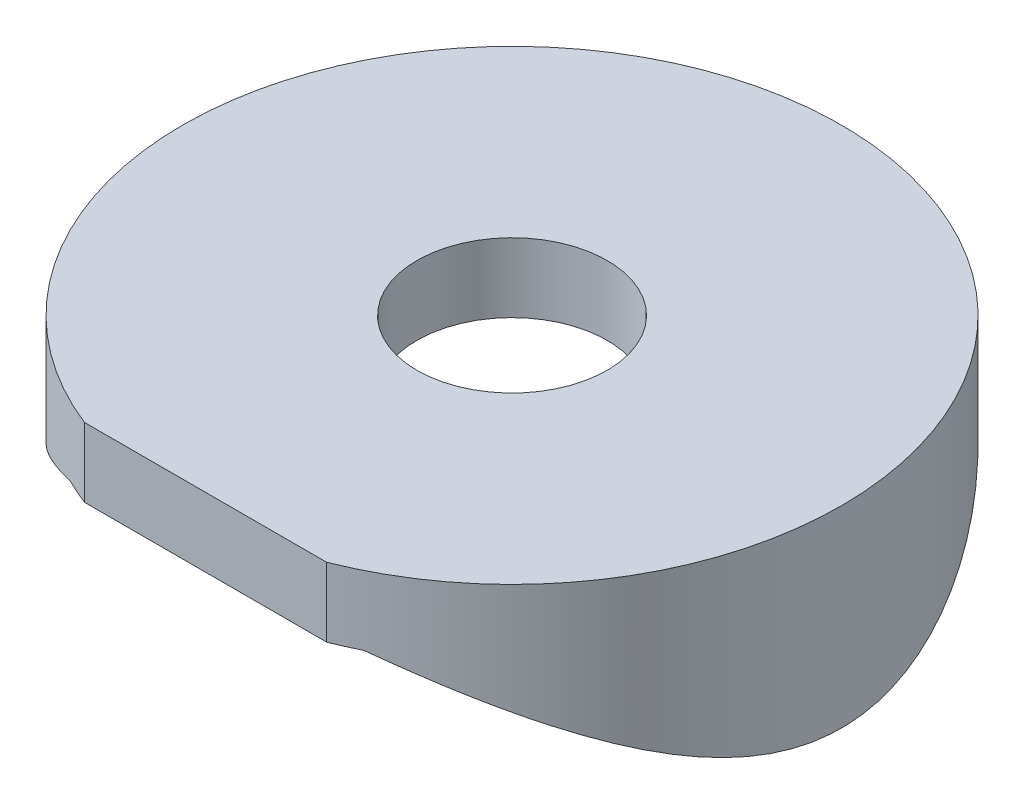
ISO-10303-21;
HEADER;
FILE_DESCRIPTION(('STEP AP214'),'2;1');
FILE_NAME('part.step','',(''),(''),'','','');
FILE_SCHEMA(('AUTOMOTIVE_DESIGN { 1 0 10303 214 1 1 1 1 }'));
ENDSEC;
DATA;
#1=APPLICATION_CONTEXT('core data for automotive mechanical design processes');
#2=APPLICATION_PROTOCOL_DEFINITION('international standard','automotive_design',2000,#1);
#3=PRODUCT_CONTEXT('',#1,'mechanical');
#4=PRODUCT('Part','Part','',(#3));
#5=PRODUCT_RELATED_PRODUCT_CATEGORY('part','',(#4));
#6=PRODUCT_DEFINITION_FORMATION('','',#4);
#7=PRODUCT_DEFINITION_CONTEXT('part definition',#1,'design');
#8=PRODUCT_DEFINITION('design','',#6,#7);
#9=PRODUCT_DEFINITION_SHAPE('','',#8);
#10=(LENGTH_UNIT() NAMED_UNIT(*) SI_UNIT(.MILLI.,.METRE.));
#11=(NAMED_UNIT(*) PLANE_ANGLE_UNIT() SI_UNIT($,.RADIAN.));
#12=(NAMED_UNIT(*) SI_UNIT($,.STERADIAN.) SOLID_ANGLE_UNIT());
#13=UNCERTAINTY_MEASURE_WITH_UNIT(LENGTH_MEASURE(1.E-05),#10,'distance_accuracy_value','');
#14=(GEOMETRIC_REPRESENTATION_CONTEXT(3) GLOBAL_UNCERTAINTY_ASSIGNED_CONTEXT((#13)) GLOBAL_UNIT_ASSIGNED_CONTEXT((#10,
#11,#12)) REPRESENTATION_CONTEXT('',''));
#15=CARTESIAN_POINT('',(0.,0.,0.));
#16=DIRECTION('',(0.,0.,1.));
#17=DIRECTION('',(1.,0.,0.));
#18=AXIS2_PLACEMENT_3D('',#15,#16,#17);
#19=CARTESIAN_POINT('',(0.,2.,0.));
#20=DIRECTION('',(0.,-1.,0.));
#21=DIRECTION('',(0.,0.,-1.));
#22=AXIS2_PLACEMENT_3D('',#19,#20,#21);
#23=CYLINDRICAL_SURFACE('',#22,9.525);
#24=CARTESIAN_POINT('',(0.,0.,0.));
#25=DIRECTION('',(0.,1.,0.));
#26=DIRECTION('',(0.,0.,1.));
#27=AXIS2_PLACEMENT_3D('',#24,#25,#26);
#28=CIRCLE('',#27,9.525);
#29=CARTESIAN_POINT('',(-4.24371299689314,0.,8.52739848957467));
#30=VERTEX_POINT('',#29);
#31=CARTESIAN_POINT('',(-3.5,0.,8.85864690570744));
#32=VERTEX_POINT('',#31);
#33=EDGE_CURVE('E92',#30,#32,#28,.T.);
#34=ORIENTED_EDGE('',*,*,#33,.T.);
#35=DIRECTION('',(0.,1.,0.));
#36=VECTOR('',#35,1.);
#37=CARTESIAN_POINT('',(-3.5,-4.28727802090018,8.85864690570744));
#38=LINE('',#37,#36);
#39=CARTESIAN_POINT('',(-3.5,2.,8.85864690570744));
#40=VERTEX_POINT('',#39);
#41=EDGE_CURVE('E52',#32,#40,#38,.T.);
#42=ORIENTED_EDGE('',*,*,#41,.T.);
#43=CARTESIAN_POINT('',(0.,2.,0.));
#44=DIRECTION('',(0.,1.,0.));
#45=DIRECTION('',(0.,0.,1.));
#46=AXIS2_PLACEMENT_3D('',#43,#44,#45);
#47=CIRCLE('',#46,9.525);
#48=CARTESIAN_POINT('',(3.5,2.,8.85864690570744));
#49=VERTEX_POINT('',#48);
#50=EDGE_CURVE('E45',#49,#40,#47,.T.);
#51=ORIENTED_EDGE('',*,*,#50,.F.);
#52=DIRECTION('',(0.,1.,0.));
#53=VECTOR('',#52,1.);
#54=CARTESIAN_POINT('',(3.5,-4.28727802090018,8.85864690570744));
#55=LINE('',#54,#53);
#56=CARTESIAN_POINT('',(3.5,0.,8.85864690570744));
#57=VERTEX_POINT('',#56);
#58=EDGE_CURVE('E75',#57,#49,#55,.T.);
#59=ORIENTED_EDGE('',*,*,#58,.F.);
#60=CARTESIAN_POINT('',(4.24371299689325,0.,8.52739848957461));
#61=VERTEX_POINT('',#60);
#62=EDGE_CURVE('E93',#57,#61,#28,.T.);
#63=ORIENTED_EDGE('',*,*,#62,.T.);
#64=CARTESIAN_POINT('',(0.,0.730000000000008,9.525));
#65=CARTESIAN_POINT('',(-0.232598410215062,0.729997784880346,9.52499770537466));
#66=CARTESIAN_POINT('',(-0.465255043659899,0.723594419233629,9.51646441280711));
#67=CARTESIAN_POINT('',(-0.928731542203984,0.698124794080122,9.48246454253932));
#68=CARTESIAN_POINT('',(-1.15955022456092,0.679050957536793,9.45698783253794));
#69=CARTESIAN_POINT('',(-1.61788138907552,0.628639507931946,9.38945410865233));
#70=CARTESIAN_POINT('',(-1.84538601285295,0.597276517669206,9.34736278411965));
#71=CARTESIAN_POINT('',(-2.29495024679384,0.52300312285786,9.24726320460812));
#72=CARTESIAN_POINT('',(-2.51700921204194,0.480091357754493,9.18925307422776));
#73=CARTESIAN_POINT('',(-2.95287619196027,0.383947739118806,9.05856475718707));
#74=CARTESIAN_POINT('',(-3.16672702846888,0.330781918858265,8.98598030840226));
#75=CARTESIAN_POINT('',(-3.58650782411301,0.2150061841728,8.82683302993598));
#76=CARTESIAN_POINT('',(-3.79243753837846,0.152395978082289,8.74026976854897));
#77=CARTESIAN_POINT('',(-4.19537242080673,0.0189061870722155,8.55416263232319));
#78=CARTESIAN_POINT('',(-4.39238304196275,-0.0519682477914907,8.45462683713033));
#79=CARTESIAN_POINT('',(-4.77703365278765,-0.200866504160065,8.24340590594804));
#80=CARTESIAN_POINT('',(-4.96467037099412,-0.278892795079052,8.1317165710379));
#81=CARTESIAN_POINT('',(-5.3469201514456,-0.448364136377898,7.88621098652338));
#82=CARTESIAN_POINT('',(-5.54057769573136,-0.540382977432084,7.75130388739916));
#83=CARTESIAN_POINT('',(-5.91568315667958,-0.729943727963059,7.4689650749191));
#84=CARTESIAN_POINT('',(-6.09712948399906,-0.827486353353695,7.3215317368469));
#85=CARTESIAN_POINT('',(-6.44778420780654,-1.02665526281829,7.01470349485184));
#86=CARTESIAN_POINT('',(-6.61697329945017,-1.12828761270504,6.85529049449163));
#87=CARTESIAN_POINT('',(-6.94253873877991,-1.3338253104432,6.52537216795236));
#88=CARTESIAN_POINT('',(-7.09891856083469,-1.43773003218695,6.35486987227902));
#89=CARTESIAN_POINT('',(-7.42924361456874,-1.66735037142117,5.96735473556684));
#90=CARTESIAN_POINT('',(-7.60028683022929,-1.79320133941891,5.74793814872372));
#91=CARTESIAN_POINT('',(-7.92317135813283,-2.04251439337706,5.29401574987367));
#92=CARTESIAN_POINT('',(-8.07500688015765,-2.16597574952667,5.05950541980315));
#93=CARTESIAN_POINT('',(-8.35856892368081,-2.40658801411154,4.57585064363559));
#94=CARTESIAN_POINT('',(-8.49031554436688,-2.52374515301034,4.32672117448652));
#95=CARTESIAN_POINT('',(-8.73266391872264,-2.7473240142314,3.81400842014086));
#96=CARTESIAN_POINT('',(-8.84327771034297,-2.85375183190743,3.55043347434462));
#97=CARTESIAN_POINT('',(-9.07289082290386,-3.08144818265368,2.92423440345876));
#98=CARTESIAN_POINT('',(-9.18375570494739,-3.19700125153533,2.55634618964748));
#99=CARTESIAN_POINT('',(-9.31693272394686,-3.33929966216403,1.98949342967779));
#100=CARTESIAN_POINT('',(-9.35579238340935,-3.38154546689201,1.79815152694902));
#101=CARTESIAN_POINT('',(-9.42190755651645,-3.45412803377018,1.41128534343643));
#102=CARTESIAN_POINT('',(-9.44916905017662,-3.48447093242942,1.21576327269906));
#103=CARTESIAN_POINT('',(-9.49175093120859,-3.53212661475591,0.819931641751597));
#104=CARTESIAN_POINT('',(-9.50695584288417,-3.54931333820688,0.619594283090086));
#105=CARTESIAN_POINT('',(-9.52463756517345,-3.5693177399549,0.217634688605466));
#106=CARTESIAN_POINT('',(-9.52711472502685,-3.57213581251663,0.0160124881894216));
#107=CARTESIAN_POINT('',(-9.51927797472328,-3.56325395323358,-0.386721449637988));
#108=CARTESIAN_POINT('',(-9.50895987824804,-3.55154926987107,-0.587832998399292));
#109=CARTESIAN_POINT('',(-9.47577623694839,-3.51421609025589,-0.987696955891022));
#110=CARTESIAN_POINT('',(-9.45291056428638,-3.48858745214278,-1.18644934056466));
#111=CARTESIAN_POINT('',(-9.39823752221162,-3.42806853081765,-1.55894115012889));
#112=CARTESIAN_POINT('',(-9.36765398506627,-3.39446829558903,-1.73307473249719));
#113=CARTESIAN_POINT('',(-9.29733840597253,-3.31828412819697,-2.07751040116684));
#114=CARTESIAN_POINT('',(-9.25760310066884,-3.27569699192173,-2.2478110968948));
#115=CARTESIAN_POINT('',(-9.12533489778873,-3.13627797804692,-2.75221284355744));
#116=CARTESIAN_POINT('',(-9.01974467653151,-3.02779425061329,-3.07978065823463));
#117=CARTESIAN_POINT('',(-8.8000444037426,-2.81203662394534,-3.65531877609699));
#118=CARTESIAN_POINT('',(-8.69120308451011,-2.70831623343432,-3.90673413640179));
#119=CARTESIAN_POINT('',(-8.45417087520837,-2.49145559832314,-4.39619617446638));
#120=CARTESIAN_POINT('',(-8.32597006166463,-2.3783105361493,-4.63423590966027));
#121=CARTESIAN_POINT('',(-8.05095146916488,-2.14632334929958,-5.0971022094459));
#122=CARTESIAN_POINT('',(-7.9040955958821,-2.02746988572317,-5.32190031914974));
#123=CARTESIAN_POINT('',(-7.59262434428233,-1.78762834789266,-5.75754782161201));
#124=CARTESIAN_POINT('',(-7.42801175042008,-1.66664061079853,-5.96839939300437));
#125=CARTESIAN_POINT('',(-7.07704198259703,-1.42237752070336,-6.38093102271132));
#126=CARTESIAN_POINT('',(-6.89024071851348,-1.2991215398823,-6.58224508359024));
#127=CARTESIAN_POINT('',(-6.49870467149545,-1.05625102883639,-6.9690884796366));
#128=CARTESIAN_POINT('',(-6.29396807655043,-0.936636868194333,-7.15461621616678));
#129=CARTESIAN_POINT('',(-5.86731757455831,-0.70396557351388,-7.50845411534218));
#130=CARTESIAN_POINT('',(-5.64543332737852,-0.590897684078483,-7.67679288800723));
#131=CARTESIAN_POINT('',(-5.18476666294529,-0.373750997855305,-7.9951332282049));
#132=CARTESIAN_POINT('',(-4.94598858661175,-0.269669907035173,-8.14513947950929));
#133=CARTESIAN_POINT('',(-4.50194089789183,-0.0928099687980695,-8.39699949041203));
#134=CARTESIAN_POINT('',(-4.29955325234083,-0.0179393548401607,-8.50247725126351));
#135=CARTESIAN_POINT('',(-3.88524637203775,0.123085541101078,-8.69960271359745));
#136=CARTESIAN_POINT('',(-3.67332910865343,0.189241614813856,-8.79125325855205));
#137=CARTESIAN_POINT('',(-3.2409450414914,0.311560601891129,-8.95967102699971));
#138=CARTESIAN_POINT('',(-3.02048147562512,0.367727255708785,-9.03644382230828));
#139=CARTESIAN_POINT('',(-2.57214112621953,0.468926522258746,-9.174132017935));
#140=CARTESIAN_POINT('',(-2.34426424751586,0.513958991998155,-9.23504721459943));
#141=CARTESIAN_POINT('',(-1.88117485070086,0.592111886323232,-9.34042495997333));
#142=CARTESIAN_POINT('',(-1.64592540434317,0.625156151742246,-9.38478236939886));
#143=CARTESIAN_POINT('',(-1.17129174786374,0.678125875707877,-9.45575338512122));
#144=CARTESIAN_POINT('',(-0.931907527675333,0.698051302310307,-9.48236694821203));
#145=CARTESIAN_POINT('',(-0.451142731263297,0.724266652092926,-9.51736126051501));
#146=CARTESIAN_POINT('',(-0.209762847738749,0.730561122326416,-9.52574808985633));
#147=CARTESIAN_POINT('',(0.27289015225441,0.729360431594552,-9.52414731524006));
#148=CARTESIAN_POINT('',(0.514163275637536,0.721866357233833,-9.51416115916342));
#149=CARTESIAN_POINT('',(0.970221530746234,0.694734031928875,-9.4779342008517));
#150=CARTESIAN_POINT('',(1.18522594140875,0.676395578391791,-9.45343269028808));
#151=CARTESIAN_POINT('',(1.61193413451316,0.629116805193818,-9.39009127710347));
#152=CARTESIAN_POINT('',(1.82363781836563,0.600176169486339,-9.35125094704804));
#153=CARTESIAN_POINT('',(2.24240408735165,0.532264940815693,-9.25976200838159));
#154=CARTESIAN_POINT('',(2.44946630582467,0.493293558470771,-9.20711231301963));
#155=CARTESIAN_POINT('',(2.85778253113195,0.406052443060447,-9.088668888766));
#156=CARTESIAN_POINT('',(3.05903624715196,0.357782245356706,-9.02287450306122));
#157=CARTESIAN_POINT('',(3.46170832674589,0.250943607556622,-8.87635576566656));
#158=CARTESIAN_POINT('',(3.66288564173447,0.19207372313834,-8.79518925912205));
#159=CARTESIAN_POINT('',(4.05718446784902,0.0662840214620441,-8.62040770245547));
#160=CARTESIAN_POINT('',(4.25030324917307,-0.000638494259444614,-8.52678847827211));
#161=CARTESIAN_POINT('',(4.81639459025745,-0.211839638853181,-8.22859279471437));
#162=CARTESIAN_POINT('',(5.17640496546013,-0.366634718629805,-8.00656644809868));
#163=CARTESIAN_POINT('',(5.91519395517861,-0.722972838905428,-7.48161937195305));
#164=CARTESIAN_POINT('',(6.28706649712474,-0.928005706952503,-7.17138137065575));
#165=CARTESIAN_POINT('',(6.80424268286757,-1.24463586244904,-6.66976691949619));
#166=CARTESIAN_POINT('',(6.97007726754383,-1.35185774012789,-6.49623611830711));
#167=CARTESIAN_POINT('',(7.28787473274478,-1.56741903764504,-6.13757980438894));
#168=CARTESIAN_POINT('',(7.4398409596681,-1.67575818083018,-5.9524571070298));
#169=CARTESIAN_POINT('',(7.75723803942549,-1.91209280572885,-5.53463917269903));
#170=CARTESIAN_POINT('',(7.91972498268418,-2.03990407034961,-5.29959643233718));
#171=CARTESIAN_POINT('',(8.22407002224665,-2.29045842955248,-4.81377999942571));
#172=CARTESIAN_POINT('',(8.36592053924664,-2.41319965022731,-4.56300057529893));
#173=CARTESIAN_POINT('',(8.62755269861824,-2.6487213290124,-4.04655038326069));
#174=CARTESIAN_POINT('',(8.74738621632674,-2.76152486637515,-3.78091659375439));
#175=CARTESIAN_POINT('',(8.96374931342852,-2.97200160800696,-3.23465027320813));
#176=CARTESIAN_POINT('',(9.06029821303677,-3.0696873318697,-2.95403041454931));
#177=CARTESIAN_POINT('',(9.19538088925355,-3.20983797334353,-2.49080457004184));
#178=CARTESIAN_POINT('',(9.24187536139896,-3.25900515081518,-2.31251593858914));
#179=CARTESIAN_POINT('',(9.32482041082044,-3.34785294965306,-1.95132131428183));
#180=CARTESIAN_POINT('',(9.36127451051946,-3.38753689733377,-1.76841696538631));
#181=CARTESIAN_POINT('',(9.42353799998037,-3.45594828483805,-1.39912452394422));
#182=CARTESIAN_POINT('',(9.44936706451035,-3.48469596824904,-1.21274354461994));
#183=CARTESIAN_POINT('',(9.49000430527952,-3.5301685187507,-0.837308190666257));
#184=CARTESIAN_POINT('',(9.50481245367254,-3.54689335546365,-0.648253809283296));
#185=CARTESIAN_POINT('',(9.52314437277054,-3.56762421254677,-0.26791206996816));
#186=CARTESIAN_POINT('',(9.52660955944233,-3.5715642009321,-0.0766182244930239));
#187=CARTESIAN_POINT('',(9.522013669086,-3.56635398935977,0.305644636727682));
#188=CARTESIAN_POINT('',(9.51395283428797,-3.55720406449882,0.496613659215265));
#189=CARTESIAN_POINT('',(9.48646814919033,-3.52622444426626,0.876886431391754));
#190=CARTESIAN_POINT('',(9.46703227819562,-3.50438133540583,1.06618820406326));
#191=CARTESIAN_POINT('',(9.4171788310777,-3.44896005188882,1.44161378002301));
#192=CARTESIAN_POINT('',(9.38675856553493,-3.41537900337912,1.62773679332552));
#193=CARTESIAN_POINT('',(9.30767924601065,-3.32932726010564,2.03589019382673));
#194=CARTESIAN_POINT('',(9.25648934050815,-3.27433411131779,2.25689863354629));
#195=CARTESIAN_POINT('',(9.13962283852913,-3.15158422019759,2.69138962783801));
#196=CARTESIAN_POINT('',(9.0739426039947,-3.08382427315555,2.90487027678351));
#197=CARTESIAN_POINT('',(8.92891861580555,-2.93811255284954,3.32405323602266));
#198=CARTESIAN_POINT('',(8.84954684631997,-2.8601399626515,3.52973852149874));
#199=CARTESIAN_POINT('',(8.67804737841284,-2.69662200106418,3.93256277868965));
#200=CARTESIAN_POINT('',(8.58591891895747,-2.61107617798372,4.1297012395992));
#201=CARTESIAN_POINT('',(8.35544253943861,-2.40401039218452,4.58226872121156));
#202=CARTESIAN_POINT('',(8.21214891636628,-2.28030703718295,4.83419018387519));
#203=CARTESIAN_POINT('',(7.90459935313562,-2.02782027405293,5.32223267247765));
#204=CARTESIAN_POINT('',(7.74033688147033,-1.89903529174028,5.55834874017188));
#205=CARTESIAN_POINT('',(7.39140210770499,-1.6402177808203,6.01459276960201));
#206=CARTESIAN_POINT('',(7.20671452161751,-1.51018438538748,6.23470855150504));
#207=CARTESIAN_POINT('',(6.81750117884972,-1.2524367874192,6.65807524373903));
#208=CARTESIAN_POINT('',(6.61297783315312,-1.12472230526073,6.86132819814344));
#209=CARTESIAN_POINT('',(6.1826577465037,-0.87372545971166,7.25158134676273));
#210=CARTESIAN_POINT('',(5.95669661996761,-0.750489381997961,7.43843054367878));
#211=CARTESIAN_POINT('',(5.4854650865437,-0.512717734465105,7.79244058955538));
#212=CARTESIAN_POINT('',(5.24019216196744,-0.398183302921064,7.95959886428652));
#213=CARTESIAN_POINT('',(4.73172065539361,-0.181145579604288,8.27195851989296));
#214=CARTESIAN_POINT('',(4.46855745724529,-0.0786195719222192,8.41720151229645));
#215=CARTESIAN_POINT('',(3.92535711682987,0.111566788185704,8.68381302574894));
#216=CARTESIAN_POINT('',(3.64532878107418,0.199234809375021,8.80519386815417));
#217=CARTESIAN_POINT('',(3.15483755647595,0.33371588112683,8.98998255594973));
#218=CARTESIAN_POINT('',(2.94803837890464,0.384972532159451,9.05995519747715));
#219=CARTESIAN_POINT('',(2.52811536027709,0.477683378935717,9.18598243919434));
#220=CARTESIAN_POINT('',(2.31499306895248,0.519139954603647,9.24204041869143));
#221=CARTESIAN_POINT('',(1.8841572616285,0.591351791336954,9.3393921612898));
#222=CARTESIAN_POINT('',(1.66645561414227,0.622131787630007,9.38072005688152));
#223=CARTESIAN_POINT('',(1.2275063095186,0.672467167534588,9.44818018779917));
#224=CARTESIAN_POINT('',(1.00626052537573,0.692028291173255,9.47432019395067));
#225=CARTESIAN_POINT('',(0.653841602201369,0.713829749081087,9.50343133828639));
#226=CARTESIAN_POINT('',(0.523297100981911,0.719888168498215,9.51151406370336));
#227=CARTESIAN_POINT('',(0.261841253101264,0.727974241837611,9.52229947341923));
#228=CARTESIAN_POINT('',(0.130929850781394,0.730001246892825,9.52500129164664));
#229=CARTESIAN_POINT('',(0.,0.730000000000008,9.525));
#230=B_SPLINE_CURVE_WITH_KNOTS('',3,(#64,#65,#66,#67,#68,#69,#70,#71,#72,#73,#74,#75,#76,#77,
#78,#79,#80,#81,#82,#83,#84,#85,#86,#87,#88,#89,#90,#91,#92,#93,#94,#95,#96,#97,#98,#99,#100,
#101,#102,#103,#104,#105,#106,#107,#108,#109,#110,#111,#112,#113,#114,#115,#116,#117,#118,#119,
#120,#121,#122,#123,#124,#125,#126,#127,#128,#129,#130,#131,#132,#133,#134,#135,#136,#137,#138,
#139,#140,#141,#142,#143,#144,#145,#146,#147,#148,#149,#150,#151,#152,#153,#154,#155,#156,#157,
#158,#159,#160,#161,#162,#163,#164,#165,#166,#167,#168,#169,#170,#171,#172,#173,#174,#175,#176,
#177,#178,#179,#180,#181,#182,#183,#184,#185,#186,#187,#188,#189,#190,#191,#192,#193,#194,#195,
#196,#197,#198,#199,#200,#201,#202,#203,#204,#205,#206,#207,#208,#209,#210,#211,#212,#213,#214,
#215,#216,#217,#218,#219,#220,#221,#222,#223,#224,#225,#226,#227,#228,#229),.UNSPECIFIED.,.T.,
.F.,(4,2,2,2,2,2,2,2,2,2,2,2,2,2,2,2,2,2,2,2,2,2,2,2,2,2,2,2,2,2,2,2,2,2,2,2,2,2,2,2,2,2,2,2,2,
2,2,2,2,2,2,2,2,2,2,2,2,2,2,2,2,2,2,2,2,2,2,2,2,2,2,2,2,2,2,2,2,2,2,2,2,2,4),(0.,
0.697653939203348,1.39572545671891,2.09524615954066,2.79484930861046,3.49008918717023,
4.18535054082455,4.88018091793173,5.57525211844908,6.33450107360671,7.09384865796304,
7.85436730572987,8.61467898363796,9.52972294108569,10.4450420873266,11.3594393503664,
12.2733141795704,13.4720636536311,14.0707617501802,14.6691507827158,15.2732040896344,
15.8772408217077,16.4814752330797,17.0857158006462,17.625072098054,18.1646210187582,
19.2438192310668,20.121586664938,20.9998055701551,21.8798475618315,22.759751753028,
23.6618728890973,24.5640852720137,25.464770620735,26.3652253703431,27.0851175984788,
27.804861583331,28.5243354961711,29.2438186485131,29.9677956754763,30.6917744653067,
31.4155117110018,32.1391919251112,32.7899506227011,33.4407287207127,34.0915580481619,
34.7424199043493,35.4160747981347,36.089956067903,37.4367284882632,39.0084124228297,
39.7965847597036,40.5845664069831,41.5225526124656,42.4608824545274,43.3969722767133,
44.3322826932026,44.9039045531831,45.475325617213,46.0456837443115,46.6160433125094,
47.1893440594319,47.7626327580819,48.3365283825988,48.9105646151239,49.6097971207487,
50.3092053814685,51.0100621369594,51.7109607219282,52.6550455615981,53.5994251915141,
54.5445163385171,55.4894927558339,56.4424133450236,57.3954583732926,58.3466704026116,
59.29738997064,59.9694860146033,60.64141867363,61.3117840524026,61.9818061385663,
62.3744529653761,62.7671629846428),.UNSPECIFIED.);
#231=CARTESIAN_POINT('',(4.24371299689325,0.,-8.52739848957461));
#232=VERTEX_POINT('',#231);
#233=EDGE_CURVE('E118',#232,#61,#230,.T.);
#234=ORIENTED_EDGE('',*,*,#233,.F.);
#235=CARTESIAN_POINT('',(-4.24371299689314,0.,-8.52739848957466));
#236=VERTEX_POINT('',#235);
#237=EDGE_CURVE('E89',#232,#236,#28,.T.);
#238=ORIENTED_EDGE('',*,*,#237,.T.);
#239=EDGE_CURVE('E58',#30,#236,#230,.T.);
#240=ORIENTED_EDGE('',*,*,#239,.F.);
#241=EDGE_LOOP('',(#34,#42,#51,#59,#63,#234,#238,#240));
#242=FACE_BOUND('',#241,.T.);
#243=ADVANCED_FACE('F38',(#242),#23,.T.);
#244=CARTESIAN_POINT('',(0.,2.,0.));
#245=DIRECTION('',(0.,1.,0.));
#246=DIRECTION('',(0.,0.,1.));
#247=AXIS2_PLACEMENT_3D('',#244,#245,#246);
#248=PLANE('',#247);
#249=DIRECTION('',(-1.,0.,0.));
#250=VECTOR('',#249,1.);
#251=CARTESIAN_POINT('',(-3.5,2.,8.85864690570744));
#252=LINE('',#251,#250);
#253=EDGE_CURVE('E78',#49,#40,#252,.T.);
#254=ORIENTED_EDGE('',*,*,#253,.F.);
#255=ORIENTED_EDGE('',*,*,#50,.T.);
#256=EDGE_LOOP('',(#254,#255));
#257=FACE_BOUND('',#256,.T.);
#258=CARTESIAN_POINT('',(0.,2.,0.));
#259=DIRECTION('',(0.,1.,0.));
#260=DIRECTION('',(0.,0.,1.));
#261=AXIS2_PLACEMENT_3D('',#258,#259,#260);
#262=CIRCLE('',#261,2.74999999999999);
#263=CARTESIAN_POINT('',(0.,2.,2.74999999999999));
#264=VERTEX_POINT('',#263);
#265=EDGE_CURVE('E101',#264,#264,#262,.T.);
#266=ORIENTED_EDGE('',*,*,#265,.F.);
#267=EDGE_LOOP('',(#266));
#268=FACE_BOUND('',#267,.T.);
#269=ADVANCED_FACE('F85',(#257,#268),#248,.T.);
#270=CARTESIAN_POINT('',(0.,0.,0.));
#271=DIRECTION('',(0.,1.,0.));
#272=DIRECTION('',(0.,0.,1.));
#273=AXIS2_PLACEMENT_3D('',#270,#271,#272);
#274=PLANE('',#273);
#275=CARTESIAN_POINT('',(0.,0.,0.));
#276=DIRECTION('',(0.,1.,0.));
#277=DIRECTION('',(0.,0.,1.));
#278=AXIS2_PLACEMENT_3D('',#275,#276,#277);
#279=CIRCLE('',#278,2.75);
#280=CARTESIAN_POINT('',(0.,0.,2.75));
#281=VERTEX_POINT('',#280);
#282=EDGE_CURVE('E95',#281,#281,#279,.T.);
#283=ORIENTED_EDGE('',*,*,#282,.T.);
#284=EDGE_LOOP('',(#283));
#285=FACE_BOUND('',#284,.T.);
#286=ORIENTED_EDGE('',*,*,#62,.F.);
#287=DIRECTION('',(-1.,0.,0.));
#288=VECTOR('',#287,1.);
#289=CARTESIAN_POINT('',(0.,0.,8.85864690570744));
#290=LINE('',#289,#288);
#291=EDGE_CURVE('E11',#57,#32,#290,.T.);
#292=ORIENTED_EDGE('',*,*,#291,.T.);
#293=ORIENTED_EDGE('',*,*,#33,.F.);
#294=DIRECTION('',(0.,0.,-1.));
#295=VECTOR('',#294,1.);
#296=CARTESIAN_POINT('',(-4.24371299689314,0.,50.));
#297=LINE('',#296,#295);
#298=EDGE_CURVE('E109',#30,#236,#297,.T.);
#299=ORIENTED_EDGE('',*,*,#298,.T.);
#300=ORIENTED_EDGE('',*,*,#237,.F.);
#301=DIRECTION('',(0.,0.,-1.));
#302=VECTOR('',#301,1.);
#303=CARTESIAN_POINT('',(4.24371299689325,0.,50.));
#304=LINE('',#303,#302);
#305=EDGE_CURVE('E105',#232,#61,#304,.F.);
#306=ORIENTED_EDGE('',*,*,#305,.T.);
#307=EDGE_LOOP('',(#286,#292,#293,#299,#300,#306));
#308=FACE_BOUND('',#307,.T.);
#309=ADVANCED_FACE('F131',(#285,#308),#274,.F.);
#310=CARTESIAN_POINT('',(0.,2.,0.));
#311=DIRECTION('',(0.,1.,0.));
#312=DIRECTION('',(0.,0.,1.));
#313=AXIS2_PLACEMENT_3D('',#310,#311,#312);
#314=CYLINDRICAL_SURFACE('',#313,2.74999999999999);
#315=ORIENTED_EDGE('',*,*,#282,.F.);
#316=EDGE_LOOP('',(#315));
#317=FACE_BOUND('',#316,.T.);
#318=ORIENTED_EDGE('',*,*,#265,.T.);
#319=EDGE_LOOP('',(#318));
#320=FACE_BOUND('',#319,.T.);
#321=ADVANCED_FACE('F128',(#317,#320),#314,.F.);
#322=CARTESIAN_POINT('',(0.,-11.97,50.));
#323=DIRECTION('',(0.,0.,-1.));
#324=DIRECTION('',(-1.,0.,0.));
#325=AXIS2_PLACEMENT_3D('',#322,#323,#324);
#326=CYLINDRICAL_SURFACE('',#325,12.7);
#327=ORIENTED_EDGE('',*,*,#298,.F.);
#328=ORIENTED_EDGE('',*,*,#239,.T.);
#329=EDGE_LOOP('',(#327,#328));
#330=FACE_BOUND('',#329,.T.);
#331=ADVANCED_FACE('F126',(#330),#326,.F.);
#332=ORIENTED_EDGE('',*,*,#305,.F.);
#333=ORIENTED_EDGE('',*,*,#233,.T.);
#334=EDGE_LOOP('',(#332,#333));
#335=FACE_BOUND('',#334,.T.);
#336=ADVANCED_FACE('F122',(#335),#326,.F.);
#337=CARTESIAN_POINT('',(-3.5,-4.28727802090018,8.85864690570744));
#338=DIRECTION('',(0.,0.,-1.));
#339=DIRECTION('',(-1.,0.,0.));
#340=AXIS2_PLACEMENT_3D('',#337,#338,#339);
#341=PLANE('',#340);
#342=ORIENTED_EDGE('',*,*,#58,.T.);
#343=ORIENTED_EDGE('',*,*,#253,.T.);
#344=ORIENTED_EDGE('',*,*,#41,.F.);
#345=ORIENTED_EDGE('',*,*,#291,.F.);
#346=EDGE_LOOP('',(#342,#343,#344,#345));
#347=FACE_BOUND('',#346,.T.);
#348=ADVANCED_FACE('F77',(#347),#341,.F.);
#349=CLOSED_SHELL('',(#243,#269,#309,#321,#331,#336,#348));
#350=MANIFOLD_SOLID_BREP('B2',#349);
#351=ADVANCED_BREP_SHAPE_REPRESENTATION('',(#18,#350),#14);
#352=SHAPE_DEFINITION_REPRESENTATION(#9,#351);
ENDSEC;
END-ISO-10303-21;
